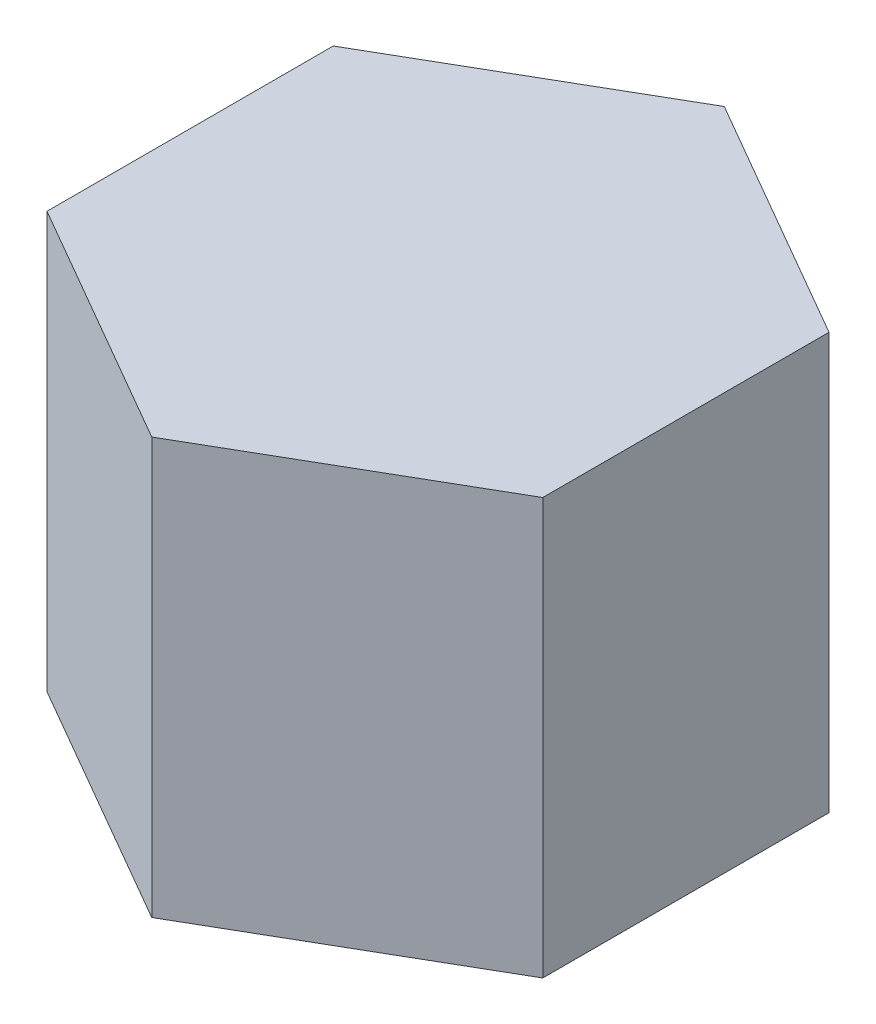
ISO-10303-21;
HEADER;
FILE_DESCRIPTION(('STEP AP214'),'2;1');
FILE_NAME('part.step','',(''),(''),'','','');
FILE_SCHEMA(('AUTOMOTIVE_DESIGN { 1 0 10303 214 1 1 1 1 }'));
ENDSEC;
DATA;
#1=APPLICATION_CONTEXT('core data for automotive mechanical design processes');
#2=APPLICATION_PROTOCOL_DEFINITION('international standard','automotive_design',2000,#1);
#3=PRODUCT_CONTEXT('',#1,'mechanical');
#4=PRODUCT('Part','Part','',(#3));
#5=PRODUCT_RELATED_PRODUCT_CATEGORY('part','',(#4));
#6=PRODUCT_DEFINITION_FORMATION('','',#4);
#7=PRODUCT_DEFINITION_CONTEXT('part definition',#1,'design');
#8=PRODUCT_DEFINITION('design','',#6,#7);
#9=PRODUCT_DEFINITION_SHAPE('','',#8);
#10=(LENGTH_UNIT() NAMED_UNIT(*) SI_UNIT(.MILLI.,.METRE.));
#11=(NAMED_UNIT(*) PLANE_ANGLE_UNIT() SI_UNIT($,.RADIAN.));
#12=(NAMED_UNIT(*) SI_UNIT($,.STERADIAN.) SOLID_ANGLE_UNIT());
#13=UNCERTAINTY_MEASURE_WITH_UNIT(LENGTH_MEASURE(1.E-05),#10,'distance_accuracy_value','');
#14=(GEOMETRIC_REPRESENTATION_CONTEXT(3) GLOBAL_UNCERTAINTY_ASSIGNED_CONTEXT((#13)) GLOBAL_UNIT_ASSIGNED_CONTEXT((#10,
#11,#12)) REPRESENTATION_CONTEXT('',''));
#15=CARTESIAN_POINT('',(0.,0.,0.));
#16=DIRECTION('',(0.,0.,1.));
#17=DIRECTION('',(1.,0.,0.));
#18=AXIS2_PLACEMENT_3D('',#15,#16,#17);
#19=CARTESIAN_POINT('',(210.839551417382,-147.556598747966,290.81594581671));
#20=DIRECTION('',(-0.499999999999943,0.,-0.866025403784471));
#21=DIRECTION('',(-0.866025403784471,0.,0.499999999999943));
#22=AXIS2_PLACEMENT_3D('',#19,#20,#21);
#23=PLANE('',#22);
#24=CARTESIAN_POINT('',(211.142660308706,-147.047793579175,290.64094581671));
#25=DIRECTION('',(-0.866025403784471,0.,0.499999999999943));
#26=VECTOR('',#25,1.);
#27=LINE('',#24,#26);
#28=CARTESIAN_POINT('',(211.142660308706,-147.047793579175,290.64094581671));
#29=VERTEX_POINT('',#28);
#30=CARTESIAN_POINT('',(210.839551417382,-147.047793579175,290.81594581671));
#31=VERTEX_POINT('',#30);
#32=EDGE_CURVE('E170',#29,#31,#27,.T.);
#33=ORIENTED_EDGE('',*,*,#32,.T.);
#34=CARTESIAN_POINT('',(210.839551417382,-147.556598747966,290.81594581671));
#35=DIRECTION('',(0.,1.,0.));
#36=VECTOR('',#35,1.);
#37=LINE('',#34,#36);
#38=CARTESIAN_POINT('',(210.839551417382,-147.556598747966,290.81594581671));
#39=VERTEX_POINT('',#38);
#40=EDGE_CURVE('E35',#39,#31,#37,.T.);
#41=ORIENTED_EDGE('',*,*,#40,.F.);
#42=CARTESIAN_POINT('',(211.142660308706,-147.556598747966,290.64094581671));
#43=DIRECTION('',(-0.866025403784471,0.,0.499999999999943));
#44=VECTOR('',#43,1.);
#45=LINE('',#42,#44);
#46=CARTESIAN_POINT('',(211.142660308706,-147.556598747966,290.64094581671));
#47=VERTEX_POINT('',#46);
#48=EDGE_CURVE('E159',#47,#39,#45,.T.);
#49=ORIENTED_EDGE('',*,*,#48,.F.);
#50=CARTESIAN_POINT('',(211.142660308706,-147.556598747966,290.64094581671));
#51=DIRECTION('',(0.,1.,0.));
#52=VECTOR('',#51,1.);
#53=LINE('',#50,#52);
#54=EDGE_CURVE('E10',#47,#29,#53,.T.);
#55=ORIENTED_EDGE('',*,*,#54,.T.);
#56=EDGE_LOOP('',(#33,#41,#49,#55));
#57=FACE_BOUND('',#56,.T.);
#58=ADVANCED_FACE('F16',(#57),#23,.F.);
#59=CARTESIAN_POINT('',(211.142660308706,-147.556598747966,291.594471220494));
#60=DIRECTION('',(-1.,0.,0.));
#61=DIRECTION('',(0.,-1.,0.));
#62=AXIS2_PLACEMENT_3D('',#59,#60,#61);
#63=PLANE('',#62);
#64=CARTESIAN_POINT('',(211.142660308706,-147.047793579175,290.29094581671));
#65=DIRECTION('',(0.,0.,1.));
#66=VECTOR('',#65,1.);
#67=LINE('',#64,#66);
#68=CARTESIAN_POINT('',(211.142660308706,-147.047793579175,290.29094581671));
#69=VERTEX_POINT('',#68);
#70=EDGE_CURVE('E167',#69,#29,#67,.T.);
#71=ORIENTED_EDGE('',*,*,#70,.T.);
#72=ORIENTED_EDGE('',*,*,#54,.F.);
#73=CARTESIAN_POINT('',(211.142660308706,-147.556598747966,290.29094581671));
#74=DIRECTION('',(0.,0.,1.));
#75=VECTOR('',#74,1.);
#76=LINE('',#73,#75);
#77=CARTESIAN_POINT('',(211.142660308706,-147.556598747966,290.29094581671));
#78=VERTEX_POINT('',#77);
#79=EDGE_CURVE('E156',#78,#47,#76,.T.);
#80=ORIENTED_EDGE('',*,*,#79,.F.);
#81=CARTESIAN_POINT('',(211.142660308706,-147.556598747966,290.29094581671));
#82=DIRECTION('',(0.,1.,0.));
#83=VECTOR('',#82,1.);
#84=LINE('',#81,#83);
#85=EDGE_CURVE('E27',#78,#69,#84,.T.);
#86=ORIENTED_EDGE('',*,*,#85,.T.);
#87=EDGE_LOOP('',(#71,#72,#80,#86));
#88=FACE_BOUND('',#87,.T.);
#89=ADVANCED_FACE('F189',(#88),#63,.F.);
#90=CARTESIAN_POINT('',(211.142660308706,-147.556598747966,290.29094581671));
#91=DIRECTION('',(-0.500000000000062,0.,0.866025403784403));
#92=DIRECTION('',(0.866025403784403,0.,0.500000000000062));
#93=AXIS2_PLACEMENT_3D('',#90,#91,#92);
#94=PLANE('',#93);
#95=CARTESIAN_POINT('',(210.839551417382,-147.047793579175,290.11594581671));
#96=DIRECTION('',(0.866025403784403,0.,0.500000000000062));
#97=VECTOR('',#96,1.);
#98=LINE('',#95,#97);
#99=CARTESIAN_POINT('',(210.839551417382,-147.047793579175,290.11594581671));
#100=VERTEX_POINT('',#99);
#101=EDGE_CURVE('E163',#100,#69,#98,.T.);
#102=ORIENTED_EDGE('',*,*,#101,.T.);
#103=ORIENTED_EDGE('',*,*,#85,.F.);
#104=CARTESIAN_POINT('',(210.839551417382,-147.556598747966,290.11594581671));
#105=DIRECTION('',(0.866025403784403,0.,0.500000000000062));
#106=VECTOR('',#105,1.);
#107=LINE('',#104,#106);
#108=CARTESIAN_POINT('',(210.839551417382,-147.556598747966,290.11594581671));
#109=VERTEX_POINT('',#108);
#110=EDGE_CURVE('E106',#109,#78,#107,.T.);
#111=ORIENTED_EDGE('',*,*,#110,.F.);
#112=CARTESIAN_POINT('',(210.839551417382,-147.556598747966,290.11594581671));
#113=DIRECTION('',(0.,1.,0.));
#114=VECTOR('',#113,1.);
#115=LINE('',#112,#114);
#116=EDGE_CURVE('E94',#109,#100,#115,.T.);
#117=ORIENTED_EDGE('',*,*,#116,.T.);
#118=EDGE_LOOP('',(#102,#103,#111,#117));
#119=FACE_BOUND('',#118,.T.);
#120=ADVANCED_FACE('F198',(#119),#94,.F.);
#121=CARTESIAN_POINT('',(210.839551417382,-147.556598747966,290.11594581671));
#122=DIRECTION('',(0.499999999999943,0.,0.866025403784471));
#123=DIRECTION('',(0.866025403784471,0.,-0.499999999999943));
#124=AXIS2_PLACEMENT_3D('',#121,#122,#123);
#125=PLANE('',#124);
#126=CARTESIAN_POINT('',(210.536442526057,-147.047793579175,290.29094581671));
#127=DIRECTION('',(0.866025403784471,0.,-0.499999999999943));
#128=VECTOR('',#127,1.);
#129=LINE('',#126,#128);
#130=CARTESIAN_POINT('',(210.536442526057,-147.047793579175,290.29094581671));
#131=VERTEX_POINT('',#130);
#132=EDGE_CURVE('E162',#131,#100,#129,.T.);
#133=ORIENTED_EDGE('',*,*,#132,.T.);
#134=ORIENTED_EDGE('',*,*,#116,.F.);
#135=CARTESIAN_POINT('',(210.536442526057,-147.556598747966,290.29094581671));
#136=DIRECTION('',(0.866025403784471,0.,-0.499999999999943));
#137=VECTOR('',#136,1.);
#138=LINE('',#135,#137);
#139=CARTESIAN_POINT('',(210.536442526057,-147.556598747966,290.29094581671));
#140=VERTEX_POINT('',#139);
#141=EDGE_CURVE('E98',#140,#109,#138,.T.);
#142=ORIENTED_EDGE('',*,*,#141,.F.);
#143=CARTESIAN_POINT('',(210.536442526057,-147.556598747966,290.29094581671));
#144=DIRECTION('',(0.,1.,0.));
#145=VECTOR('',#144,1.);
#146=LINE('',#143,#145);
#147=EDGE_CURVE('E79',#140,#131,#146,.T.);
#148=ORIENTED_EDGE('',*,*,#147,.T.);
#149=EDGE_LOOP('',(#133,#134,#142,#148));
#150=FACE_BOUND('',#149,.T.);
#151=ADVANCED_FACE('F100',(#150),#125,.F.);
#152=CARTESIAN_POINT('',(210.536442526057,-147.556598747966,291.594471220494));
#153=DIRECTION('',(1.,0.,0.));
#154=DIRECTION('',(0.,1.,0.));
#155=AXIS2_PLACEMENT_3D('',#152,#153,#154);
#156=PLANE('',#155);
#157=CARTESIAN_POINT('',(210.536442526057,-147.047793579175,290.64094581671));
#158=DIRECTION('',(0.,0.,-1.));
#159=VECTOR('',#158,1.);
#160=LINE('',#157,#159);
#161=CARTESIAN_POINT('',(210.536442526057,-147.047793579175,290.64094581671));
#162=VERTEX_POINT('',#161);
#163=EDGE_CURVE('E88',#162,#131,#160,.T.);
#164=ORIENTED_EDGE('',*,*,#163,.T.);
#165=ORIENTED_EDGE('',*,*,#147,.F.);
#166=CARTESIAN_POINT('',(210.536442526057,-147.556598747966,290.64094581671));
#167=DIRECTION('',(0.,0.,-1.));
#168=VECTOR('',#167,1.);
#169=LINE('',#166,#168);
#170=CARTESIAN_POINT('',(210.536442526057,-147.556598747966,290.64094581671));
#171=VERTEX_POINT('',#170);
#172=EDGE_CURVE('E84',#171,#140,#169,.T.);
#173=ORIENTED_EDGE('',*,*,#172,.F.);
#174=CARTESIAN_POINT('',(210.536442526057,-147.556598747966,290.64094581671));
#175=DIRECTION('',(0.,1.,0.));
#176=VECTOR('',#175,1.);
#177=LINE('',#174,#176);
#178=EDGE_CURVE('E58',#171,#162,#177,.T.);
#179=ORIENTED_EDGE('',*,*,#178,.T.);
#180=EDGE_LOOP('',(#164,#165,#173,#179));
#181=FACE_BOUND('',#180,.T.);
#182=ADVANCED_FACE('F82',(#181),#156,.F.);
#183=CARTESIAN_POINT('',(210.536442526057,-147.556598747966,290.64094581671));
#184=DIRECTION('',(0.499999999999943,0.,-0.866025403784471));
#185=DIRECTION('',(-0.866025403784471,0.,-0.499999999999943));
#186=AXIS2_PLACEMENT_3D('',#183,#184,#185);
#187=PLANE('',#186);
#188=CARTESIAN_POINT('',(210.839551417382,-147.047793579175,290.81594581671));
#189=DIRECTION('',(-0.866025403784471,0.,-0.499999999999943));
#190=VECTOR('',#189,1.);
#191=LINE('',#188,#190);
#192=EDGE_CURVE('E160',#31,#162,#191,.T.);
#193=ORIENTED_EDGE('',*,*,#192,.T.);
#194=ORIENTED_EDGE('',*,*,#178,.F.);
#195=CARTESIAN_POINT('',(210.839551417382,-147.556598747966,290.81594581671));
#196=DIRECTION('',(-0.866025403784471,0.,-0.499999999999943));
#197=VECTOR('',#196,1.);
#198=LINE('',#195,#197);
#199=EDGE_CURVE('E112',#39,#171,#198,.T.);
#200=ORIENTED_EDGE('',*,*,#199,.F.);
#201=ORIENTED_EDGE('',*,*,#40,.T.);
#202=EDGE_LOOP('',(#193,#194,#200,#201));
#203=FACE_BOUND('',#202,.T.);
#204=ADVANCED_FACE('F131',(#203),#187,.F.);
#205=CARTESIAN_POINT('',(206.491105863044,-147.556598747966,291.594471220494));
#206=DIRECTION('',(0.,1.,0.));
#207=DIRECTION('',(-1.,0.,0.));
#208=AXIS2_PLACEMENT_3D('',#205,#206,#207);
#209=PLANE('',#208);
#210=ORIENTED_EDGE('',*,*,#48,.T.);
#211=ORIENTED_EDGE('',*,*,#199,.T.);
#212=ORIENTED_EDGE('',*,*,#172,.T.);
#213=ORIENTED_EDGE('',*,*,#141,.T.);
#214=ORIENTED_EDGE('',*,*,#110,.T.);
#215=ORIENTED_EDGE('',*,*,#79,.T.);
#216=EDGE_LOOP('',(#210,#211,#212,#213,#214,#215));
#217=FACE_BOUND('',#216,.T.);
#218=ADVANCED_FACE('F111',(#217),#209,.F.);
#219=CARTESIAN_POINT('',(206.491105863044,-147.047793579175,291.594471220494));
#220=DIRECTION('',(0.,1.,0.));
#221=DIRECTION('',(-1.,0.,0.));
#222=AXIS2_PLACEMENT_3D('',#219,#220,#221);
#223=PLANE('',#222);
#224=ORIENTED_EDGE('',*,*,#32,.F.);
#225=ORIENTED_EDGE('',*,*,#70,.F.);
#226=ORIENTED_EDGE('',*,*,#101,.F.);
#227=ORIENTED_EDGE('',*,*,#132,.F.);
#228=ORIENTED_EDGE('',*,*,#163,.F.);
#229=ORIENTED_EDGE('',*,*,#192,.F.);
#230=EDGE_LOOP('',(#224,#225,#226,#227,#228,#229));
#231=FACE_BOUND('',#230,.T.);
#232=ADVANCED_FACE('F130',(#231),#223,.T.);
#233=CLOSED_SHELL('',(#58,#89,#120,#151,#182,#204,#218,#232));
#234=MANIFOLD_SOLID_BREP('B1',#233);
#235=ADVANCED_BREP_SHAPE_REPRESENTATION('',(#18,#234),#14);
#236=SHAPE_DEFINITION_REPRESENTATION(#9,#235);
ENDSEC;
END-ISO-10303-21;
